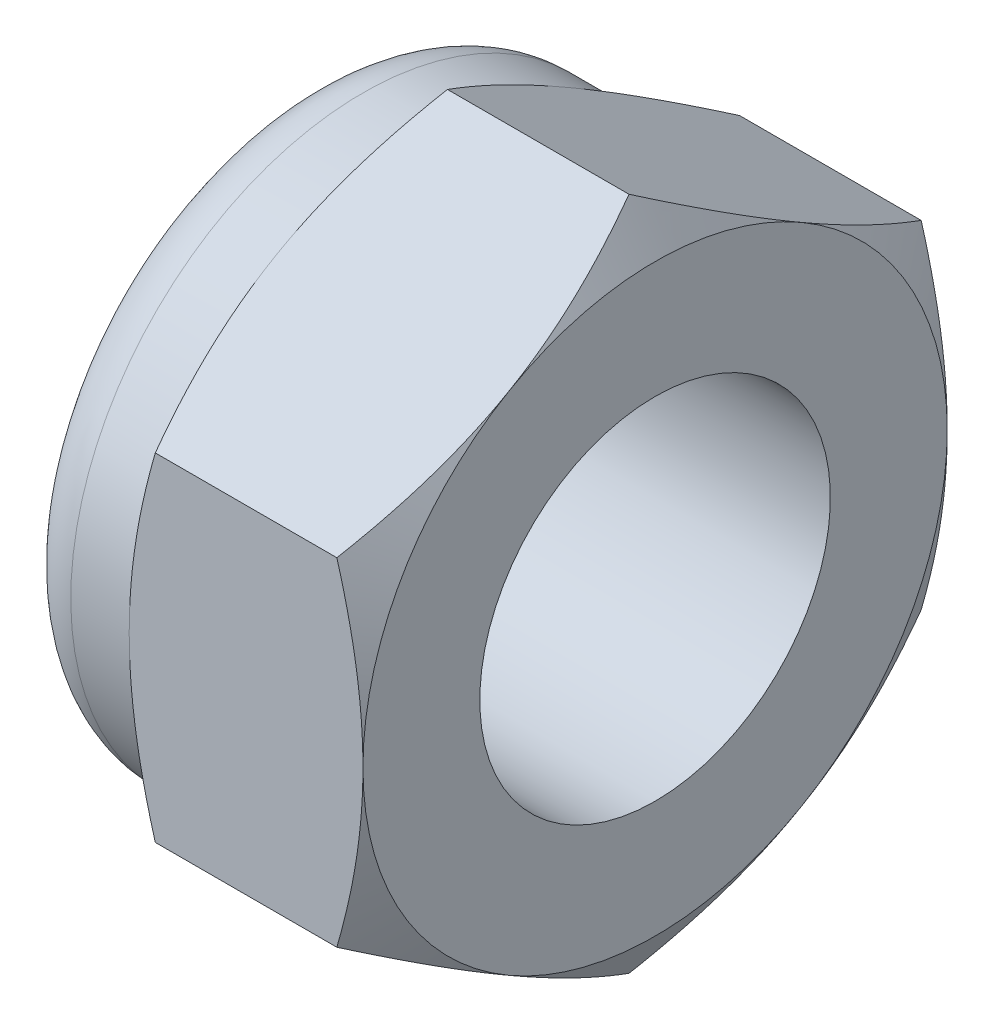
ISO-10303-21;
HEADER;
FILE_DESCRIPTION(('STEP AP214'),'2;1');
FILE_NAME('part.step','',(''),(''),'','','');
FILE_SCHEMA(('AUTOMOTIVE_DESIGN { 1 0 10303 214 1 1 1 1 }'));
ENDSEC;
DATA;
#1=APPLICATION_CONTEXT('core data for automotive mechanical design processes');
#2=APPLICATION_PROTOCOL_DEFINITION('international standard','automotive_design',2000,#1);
#3=PRODUCT_CONTEXT('',#1,'mechanical');
#4=PRODUCT('Part','Part','',(#3));
#5=PRODUCT_RELATED_PRODUCT_CATEGORY('part','',(#4));
#6=PRODUCT_DEFINITION_FORMATION('','',#4);
#7=PRODUCT_DEFINITION_CONTEXT('part definition',#1,'design');
#8=PRODUCT_DEFINITION('design','',#6,#7);
#9=PRODUCT_DEFINITION_SHAPE('','',#8);
#10=(LENGTH_UNIT() NAMED_UNIT(*) SI_UNIT(.MILLI.,.METRE.));
#11=(NAMED_UNIT(*) PLANE_ANGLE_UNIT() SI_UNIT($,.RADIAN.));
#12=(NAMED_UNIT(*) SI_UNIT($,.STERADIAN.) SOLID_ANGLE_UNIT());
#13=UNCERTAINTY_MEASURE_WITH_UNIT(LENGTH_MEASURE(1.E-05),#10,'distance_accuracy_value','');
#14=(GEOMETRIC_REPRESENTATION_CONTEXT(3) GLOBAL_UNCERTAINTY_ASSIGNED_CONTEXT((#13)) GLOBAL_UNIT_ASSIGNED_CONTEXT((#10,
#11,#12)) REPRESENTATION_CONTEXT('',''));
#15=CARTESIAN_POINT('',(0.,0.,0.));
#16=DIRECTION('',(0.,0.,1.));
#17=DIRECTION('',(1.,0.,0.));
#18=AXIS2_PLACEMENT_3D('',#15,#16,#17);
#19=CARTESIAN_POINT('',(-6.,2.88675134594813,-5.));
#20=DIRECTION('',(0.,0.866025403784439,-0.5));
#21=DIRECTION('',(0.,0.5,0.866025403784439));
#22=AXIS2_PLACEMENT_3D('',#19,#20,#21);
#23=PLANE('',#22);
#24=DIRECTION('',(1.,0.,0.));
#25=VECTOR('',#24,1.);
#26=CARTESIAN_POINT('',(-6.,2.88675134594813,-5.));
#27=LINE('',#26,#25);
#28=CARTESIAN_POINT('',(-3.5534180126148,2.88675134594813,-5.));
#29=VERTEX_POINT('',#28);
#30=CARTESIAN_POINT('',(-0.446581987385198,2.88675134594813,-5.));
#31=VERTEX_POINT('',#30);
#32=EDGE_CURVE('E160',#29,#31,#27,.T.);
#33=ORIENTED_EDGE('',*,*,#32,.F.);
#34=CARTESIAN_POINT('',(-3.55335134394818,2.88663587589429,-5.0002));
#35=CARTESIAN_POINT('',(-3.62661343236237,3.01349970319368,-4.78046540547481));
#36=CARTESIAN_POINT('',(-3.69324867808191,3.14144859993849,-4.55885141554042));
#37=CARTESIAN_POINT('',(-3.80956100898919,3.39956193532121,-4.11178600454649));
#38=CARTESIAN_POINT('',(-3.85919695008421,3.52973095989718,-3.88632664040923));
#39=CARTESIAN_POINT('',(-3.9364489745813,3.78847564779798,-3.43816769477649));
#40=CARTESIAN_POINT('',(-3.96457962171651,3.91701101576052,-3.21553790689581));
#41=CARTESIAN_POINT('',(-3.98980507804632,4.11026620624322,-2.88081009815336));
#42=CARTESIAN_POINT('',(-3.99538654023052,4.17472868879311,-2.76915780319494));
#43=CARTESIAN_POINT('',(-4.00079778324853,4.30371322717528,-2.5457500293262));
#44=CARTESIAN_POINT('',(-4.0006277417418,4.36823528110589,-2.43399455370969));
#45=CARTESIAN_POINT('',(-3.99224636820796,4.54500768479194,-2.12781576914936));
#46=CARTESIAN_POINT('',(-3.97817022810275,4.65719946015292,-1.93349391403279));
#47=CARTESIAN_POINT('',(-3.93353474289057,4.88083840557981,-1.54613989800229));
#48=CARTESIAN_POINT('',(-3.90296013985249,4.9922847895602,-1.35310909862843));
#49=CARTESIAN_POINT('',(-3.82653150637884,5.21637431361295,-0.964974657525146));
#50=CARTESIAN_POINT('',(-3.78035362112132,5.32898917185759,-0.769920001358265));
#51=CARTESIAN_POINT('',(-3.67554820550807,5.55253939626498,-0.382719654641232));
#52=CARTESIAN_POINT('',(-3.61694529656263,5.66347762579592,-0.190569004591913));
#53=CARTESIAN_POINT('',(-3.55335134394818,5.7736181619501,0.000200000000000797));
#54=B_SPLINE_CURVE_WITH_KNOTS('',3,(#34,#35,#36,#37,#38,#39,#40,#41,#42,#43,#44,#45,#46,#47,#48,
#49,#50,#51,#52,#53),.UNSPECIFIED.,.F.,.F.,(4,2,2,2,2,2,2,2,2,4),(0.,0.79255584136309,
1.58701660053333,2.3618153748728,2.74884076077325,3.13585419177295,3.80962362599679,
4.48401723901189,5.17336882348928,5.86136694793725),.UNSPECIFIED.);
#55=CARTESIAN_POINT('',(-4.,4.33012701892219,-2.5));
#56=VERTEX_POINT('',#55);
#57=EDGE_CURVE('E280',#29,#56,#54,.T.);
#58=ORIENTED_EDGE('',*,*,#57,.T.);
#59=CARTESIAN_POINT('',(-3.5534180126148,5.77350269189626,0.));
#60=VERTEX_POINT('',#59);
#61=EDGE_CURVE('E274',#56,#60,#54,.T.);
#62=ORIENTED_EDGE('',*,*,#61,.T.);
#63=DIRECTION('',(1.,0.,0.));
#64=VECTOR('',#63,1.);
#65=CARTESIAN_POINT('',(-6.,5.77350269189626,0.));
#66=LINE('',#65,#64);
#67=CARTESIAN_POINT('',(-0.446581987385198,5.77350269189626,0.));
#68=VERTEX_POINT('',#67);
#69=EDGE_CURVE('E167',#60,#68,#66,.T.);
#70=ORIENTED_EDGE('',*,*,#69,.T.);
#71=CARTESIAN_POINT('',(-0.446648656051824,5.7736181619501,0.000200000000000379));
#72=CARTESIAN_POINT('',(-0.373386567637631,5.64675433465071,-0.219534594525184));
#73=CARTESIAN_POINT('',(-0.306751321918089,5.5188054379059,-0.44114858445958));
#74=CARTESIAN_POINT('',(-0.190438991010808,5.26069210252318,-0.888213995453512));
#75=CARTESIAN_POINT('',(-0.140803049915787,5.13052307794721,-1.11367335959077));
#76=CARTESIAN_POINT('',(-0.0635510254186967,4.87177839004641,-1.56183230522351));
#77=CARTESIAN_POINT('',(-0.0354203782834888,4.74324302208387,-1.78446209310419));
#78=CARTESIAN_POINT('',(-0.0101949219536843,4.54998783160116,-2.11918990184664));
#79=CARTESIAN_POINT('',(-0.00461345976948372,4.48552534905128,-2.23084219680506));
#80=CARTESIAN_POINT('',(0.000797783248530016,4.35654081066911,-2.4542499706738));
#81=CARTESIAN_POINT('',(0.000627741741796839,4.2920187567385,-2.56600544629031));
#82=CARTESIAN_POINT('',(-0.00775363179203629,4.11524635305244,-2.87218423085064));
#83=CARTESIAN_POINT('',(-0.0218297718972512,4.00305457769146,-3.06650608596721));
#84=CARTESIAN_POINT('',(-0.06646525710943,3.77941563226457,-3.4538601019977));
#85=CARTESIAN_POINT('',(-0.0970398601475068,3.66796924828419,-3.64689090137157));
#86=CARTESIAN_POINT('',(-0.173468493621162,3.44387972423144,-4.03502534247485));
#87=CARTESIAN_POINT('',(-0.219646378878678,3.3312648659868,-4.23007999864173));
#88=CARTESIAN_POINT('',(-0.324451794491931,3.10771464157941,-4.61728034535877));
#89=CARTESIAN_POINT('',(-0.38305470343737,2.99677641204847,-4.80943099540809));
#90=CARTESIAN_POINT('',(-0.446648656051824,2.88663587589429,-5.0002));
#91=B_SPLINE_CURVE_WITH_KNOTS('',3,(#71,#72,#73,#74,#75,#76,#77,#78,#79,#80,#81,#82,#83,#84,#85,
#86,#87,#88,#89,#90),.UNSPECIFIED.,.F.,.F.,(4,2,2,2,2,2,2,2,2,4),(0.,0.79255584136309,
1.58701660053333,2.3618153748728,2.74884076077325,3.13585419177295,3.80962362599679,
4.48401723901189,5.17336882348928,5.86136694793725),.UNSPECIFIED.);
#92=CARTESIAN_POINT('',(0.,4.33012701892219,-2.5));
#93=VERTEX_POINT('',#92);
#94=EDGE_CURVE('E325',#68,#93,#91,.T.);
#95=ORIENTED_EDGE('',*,*,#94,.T.);
#96=EDGE_CURVE('E228',#93,#31,#91,.T.);
#97=ORIENTED_EDGE('',*,*,#96,.T.);
#98=EDGE_LOOP('',(#33,#58,#62,#70,#95,#97));
#99=FACE_BOUND('',#98,.T.);
#100=ADVANCED_FACE('F32',(#99),#23,.T.);
#101=CARTESIAN_POINT('',(-6.,-2.88675134594813,-5.));
#102=DIRECTION('',(0.,0.,-1.));
#103=DIRECTION('',(0.,1.,0.));
#104=AXIS2_PLACEMENT_3D('',#101,#102,#103);
#105=PLANE('',#104);
#106=DIRECTION('',(1.,0.,0.));
#107=VECTOR('',#106,1.);
#108=CARTESIAN_POINT('',(-6.,-2.88675134594813,-5.));
#109=LINE('',#108,#107);
#110=CARTESIAN_POINT('',(-3.5534180126148,-2.88675134594814,-5.));
#111=VERTEX_POINT('',#110);
#112=CARTESIAN_POINT('',(-0.446581987385198,-2.88675134594814,-5.));
#113=VERTEX_POINT('',#112);
#114=EDGE_CURVE('E157',#111,#113,#109,.T.);
#115=ORIENTED_EDGE('',*,*,#114,.F.);
#116=CARTESIAN_POINT('',(-1.60736647344924,-7.65608998744865,-5.));
#117=CARTESIAN_POINT('',(-1.71345466182796,-7.43656171400166,-5.));
#118=CARTESIAN_POINT('',(-1.81848824538408,-7.21651440170022,-5.));
#119=CARTESIAN_POINT('',(-2.02584356636027,-6.77510105921518,-5.));
#120=CARTESIAN_POINT('',(-2.12816483425435,-6.55373480873052,-5.));
#121=CARTESIAN_POINT('',(-2.33003192146512,-6.10820714710357,-5.));
#122=CARTESIAN_POINT('',(-2.42955850718272,-5.88403698971124,-5.));
#123=CARTESIAN_POINT('',(-2.62433676721321,-5.43385418074677,-5.));
#124=CARTESIAN_POINT('',(-2.71958866435759,-5.20784162594278,-5.));
#125=CARTESIAN_POINT('',(-2.90581169081061,-4.75080884782756,-5.));
#126=CARTESIAN_POINT('',(-2.99671590900132,-4.51976121099505,-5.));
#127=CARTESIAN_POINT('',(-3.17140469702806,-4.05494053422099,-5.));
#128=CARTESIAN_POINT('',(-3.25518847475236,-3.82116719434024,-5.));
#129=CARTESIAN_POINT('',(-3.41338536763539,-3.35100416711889,-5.));
#130=CARTESIAN_POINT('',(-3.48781840477474,-3.11462125088188,-5.));
#131=CARTESIAN_POINT('',(-3.62489560612763,-2.63849247870023,-5.));
#132=CARTESIAN_POINT('',(-3.68754349840306,-2.3987477121033,-5.));
#133=CARTESIAN_POINT('',(-3.79801224600514,-1.91574303714497,-5.));
#134=CARTESIAN_POINT('',(-3.84582915344136,-1.672482210841,-5.));
#135=CARTESIAN_POINT('',(-3.9234044442076,-1.18299359688664,-5.));
#136=CARTESIAN_POINT('',(-3.95316281157159,-0.936765806613283,-5.));
#137=CARTESIAN_POINT('',(-3.9823487984137,-0.56703227932385,-5.));
#138=CARTESIAN_POINT('',(-3.98950368094005,-0.444105297658542,-5.));
#139=CARTESIAN_POINT('',(-3.99860454773096,-0.198053005238567,-5.));
#140=CARTESIAN_POINT('',(-4.00055059963961,-0.074927697080231,-5.));
#141=CARTESIAN_POINT('',(-3.99918152965434,0.17125799989235,-5.));
#142=CARTESIAN_POINT('',(-3.99586788568699,0.294318397227085,-5.));
#143=CARTESIAN_POINT('',(-3.98406340271724,0.540192730788837,-5.));
#144=CARTESIAN_POINT('',(-3.97557230242984,0.663006654263479,-5.));
#145=CARTESIAN_POINT('',(-3.9488936197247,0.960681872881665,-5.));
#146=CARTESIAN_POINT('',(-3.92811103230172,1.1353143627994,-5.));
#147=CARTESIAN_POINT('',(-3.87723434427731,1.4832167579939,-5.));
#148=CARTESIAN_POINT('',(-3.84713900200997,1.65648647841237,-5.));
#149=CARTESIAN_POINT('',(-3.77870120798845,2.00155426058701,-5.));
#150=CARTESIAN_POINT('',(-3.7403505225136,2.17335067370375,-5.));
#151=CARTESIAN_POINT('',(-3.65657169461499,2.51518168221057,-5.));
#152=CARTESIAN_POINT('',(-3.611143983086,2.68521638419313,-5.));
#153=CARTESIAN_POINT('',(-3.51311221794571,3.02770318928895,-5.));
#154=CARTESIAN_POINT('',(-3.46035963617606,3.20011248435316,-5.));
#155=CARTESIAN_POINT('',(-3.34964221269737,3.54310870430181,-5.));
#156=CARTESIAN_POINT('',(-3.29168096609293,3.71369679659719,-5.));
#157=CARTESIAN_POINT('',(-3.17174345927152,4.05236610267979,-5.));
#158=CARTESIAN_POINT('',(-3.10979163457363,4.22045602230061,-5.));
#159=CARTESIAN_POINT('',(-2.98225176586187,4.55533171687455,-5.));
#160=CARTESIAN_POINT('',(-2.91666225221222,4.72211693321421,-5.));
#161=CARTESIAN_POINT('',(-2.84961374182275,4.88829623733362,-5.));
#162=B_SPLINE_CURVE_WITH_KNOTS('',3,(#116,#117,#118,#119,#120,#121,#122,#123,#124,#125,#126,
#127,#128,#129,#130,#131,#132,#133,#134,#135,#136,#137,#138,#139,#140,#141,#142,#143,#144,#145,
#146,#147,#148,#149,#150,#151,#152,#153,#154,#155,#156,#157,#158,#159,#160,#161),.UNSPECIFIED.,
.F.,.F.,(4,2,2,2,2,2,2,2,2,2,2,2,2,2,2,2,2,2,2,2,2,2,4),(0.,0.73146474066535,1.46305528824908,
2.19883243307486,2.93457117856033,3.67934251246857,4.42419659013361,5.16743580871988,
5.91043951739338,6.65364083834805,7.39684281638514,7.76615414335455,8.13546067426609,
8.50466345177854,8.87388486298451,9.40118542949726,9.92855633110015,10.4564556797854,
10.9843228991235,11.525120280828,12.065547221064,12.6029322754131,13.1405360390026),.UNSPECIFIED.);
#163=CARTESIAN_POINT('',(-4.,0.,-5.));
#164=VERTEX_POINT('',#163);
#165=EDGE_CURVE('E150',#111,#164,#162,.T.);
#166=ORIENTED_EDGE('',*,*,#165,.T.);
#167=EDGE_CURVE('E243',#164,#29,#162,.T.);
#168=ORIENTED_EDGE('',*,*,#167,.T.);
#169=ORIENTED_EDGE('',*,*,#32,.T.);
#170=CARTESIAN_POINT('',(-2.39263352655076,-7.65608998744865,-5.));
#171=CARTESIAN_POINT('',(-2.28654533817204,-7.43656171400166,-5.));
#172=CARTESIAN_POINT('',(-2.18151175461592,-7.21651440170022,-5.));
#173=CARTESIAN_POINT('',(-1.97415643363973,-6.77510105921518,-5.));
#174=CARTESIAN_POINT('',(-1.87183516574565,-6.55373480873053,-5.));
#175=CARTESIAN_POINT('',(-1.66996807853488,-6.10820714710357,-5.));
#176=CARTESIAN_POINT('',(-1.57044149281728,-5.88403698971125,-5.));
#177=CARTESIAN_POINT('',(-1.37566323278679,-5.43385418074677,-5.));
#178=CARTESIAN_POINT('',(-1.28041133564241,-5.20784162594278,-5.));
#179=CARTESIAN_POINT('',(-1.0941883091894,-4.75080884782756,-5.));
#180=CARTESIAN_POINT('',(-1.00328409099868,-4.51976121099505,-5.));
#181=CARTESIAN_POINT('',(-0.828595302971936,-4.054940534221,-5.));
#182=CARTESIAN_POINT('',(-0.74481152524764,-3.82116719434025,-5.));
#183=CARTESIAN_POINT('',(-0.58661463236461,-3.35100416711889,-5.));
#184=CARTESIAN_POINT('',(-0.512181595225262,-3.11462125088188,-5.));
#185=CARTESIAN_POINT('',(-0.37510439387237,-2.63849247870023,-5.));
#186=CARTESIAN_POINT('',(-0.312456501596944,-2.3987477121033,-5.));
#187=CARTESIAN_POINT('',(-0.201987753994865,-1.91574303714497,-5.));
#188=CARTESIAN_POINT('',(-0.154170846558639,-1.672482210841,-5.));
#189=CARTESIAN_POINT('',(-0.0765955557924009,-1.18299359688664,-5.));
#190=CARTESIAN_POINT('',(-0.0468371884284084,-0.936765806613281,-5.));
#191=CARTESIAN_POINT('',(-0.0176512015862956,-0.567032279323849,-5.));
#192=CARTESIAN_POINT('',(-0.0104963190599459,-0.444105297658541,-5.));
#193=CARTESIAN_POINT('',(-0.00139545226903983,-0.198053005238567,-5.));
#194=CARTESIAN_POINT('',(0.000550599639615223,-0.074927697080231,-5.));
#195=CARTESIAN_POINT('',(-0.000818470345663275,0.17125799989235,-5.));
#196=CARTESIAN_POINT('',(-0.00413211431301054,0.294318397227085,-5.));
#197=CARTESIAN_POINT('',(-0.0159365972827586,0.540192730788837,-5.));
#198=CARTESIAN_POINT('',(-0.0244276975701636,0.663006654263479,-5.));
#199=CARTESIAN_POINT('',(-0.0511063802752994,0.960681872881665,-5.));
#200=CARTESIAN_POINT('',(-0.0718889676982849,1.1353143627994,-5.));
#201=CARTESIAN_POINT('',(-0.122765655722694,1.4832167579939,-5.));
#202=CARTESIAN_POINT('',(-0.152860997990033,1.65648647841237,-5.));
#203=CARTESIAN_POINT('',(-0.221298792011551,2.00155426058701,-5.));
#204=CARTESIAN_POINT('',(-0.259649477486405,2.17335067370375,-5.));
#205=CARTESIAN_POINT('',(-0.343428305385012,2.51518168221057,-5.));
#206=CARTESIAN_POINT('',(-0.388856016914003,2.68521638419313,-5.));
#207=CARTESIAN_POINT('',(-0.486887782054295,3.02770318928895,-5.));
#208=CARTESIAN_POINT('',(-0.539640363823945,3.20011248435316,-5.));
#209=CARTESIAN_POINT('',(-0.65035778730263,3.54310870430181,-5.));
#210=CARTESIAN_POINT('',(-0.708319033907075,3.71369679659719,-5.));
#211=CARTESIAN_POINT('',(-0.828256540728481,4.05236610267979,-5.));
#212=CARTESIAN_POINT('',(-0.890208365426372,4.22045602230062,-5.));
#213=CARTESIAN_POINT('',(-1.01774823413813,4.55533171687455,-5.));
#214=CARTESIAN_POINT('',(-1.08333774778778,4.72211693321421,-5.));
#215=CARTESIAN_POINT('',(-1.15038625817725,4.88829623733363,-5.));
#216=B_SPLINE_CURVE_WITH_KNOTS('',3,(#170,#171,#172,#173,#174,#175,#176,#177,#178,#179,#180,
#181,#182,#183,#184,#185,#186,#187,#188,#189,#190,#191,#192,#193,#194,#195,#196,#197,#198,#199,
#200,#201,#202,#203,#204,#205,#206,#207,#208,#209,#210,#211,#212,#213,#214,#215),.UNSPECIFIED.,
.F.,.F.,(4,2,2,2,2,2,2,2,2,2,2,2,2,2,2,2,2,2,2,2,2,2,4),(0.,0.73146474066535,1.46305528824908,
2.19883243307485,2.93457117856033,3.67934251246857,4.4241965901336,5.16743580871988,
5.91043951739338,6.65364083834805,7.39684281638514,7.76615414335455,8.13546067426609,
8.50466345177854,8.87388486298451,9.40118542949726,9.92855633110015,10.4564556797854,
10.9843228991235,11.525120280828,12.0655472210641,12.6029322754131,13.1405360390026),.UNSPECIFIED.);
#217=CARTESIAN_POINT('',(0.,0.,-5.));
#218=VERTEX_POINT('',#217);
#219=EDGE_CURVE('E226',#31,#218,#216,.F.);
#220=ORIENTED_EDGE('',*,*,#219,.T.);
#221=EDGE_CURVE('E219',#218,#113,#216,.F.);
#222=ORIENTED_EDGE('',*,*,#221,.T.);
#223=EDGE_LOOP('',(#115,#166,#168,#169,#220,#222));
#224=FACE_BOUND('',#223,.T.);
#225=ADVANCED_FACE('F234',(#224),#105,.T.);
#226=CARTESIAN_POINT('',(-6.,-5.77350269189626,0.));
#227=DIRECTION('',(0.,-0.866025403784439,-0.5));
#228=DIRECTION('',(0.,0.5,-0.866025403784439));
#229=AXIS2_PLACEMENT_3D('',#226,#227,#228);
#230=PLANE('',#229);
#231=DIRECTION('',(1.,0.,0.));
#232=VECTOR('',#231,1.);
#233=CARTESIAN_POINT('',(-6.,-5.77350269189626,0.));
#234=LINE('',#233,#232);
#235=CARTESIAN_POINT('',(-3.5534180126148,-5.77350269189626,0.));
#236=VERTEX_POINT('',#235);
#237=CARTESIAN_POINT('',(-0.446581987385197,-5.77350269189626,0.));
#238=VERTEX_POINT('',#237);
#239=EDGE_CURVE('E147',#236,#238,#234,.T.);
#240=ORIENTED_EDGE('',*,*,#239,.F.);
#241=CARTESIAN_POINT('',(-3.55335134394818,-5.7736181619501,0.000200000000000594));
#242=CARTESIAN_POINT('',(-3.62661343236237,-5.64675433465071,-0.219534594525184));
#243=CARTESIAN_POINT('',(-3.69324867808191,-5.5188054379059,-0.441148584459579));
#244=CARTESIAN_POINT('',(-3.80956100898919,-5.26069210252318,-0.888213995453512));
#245=CARTESIAN_POINT('',(-3.85919695008421,-5.13052307794721,-1.11367335959077));
#246=CARTESIAN_POINT('',(-3.9364489745813,-4.87177839004641,-1.56183230522351));
#247=CARTESIAN_POINT('',(-3.96457962171651,-4.74324302208387,-1.78446209310419));
#248=CARTESIAN_POINT('',(-3.98980507804631,-4.54998783160116,-2.11918990184664));
#249=CARTESIAN_POINT('',(-3.99538654023052,-4.48552534905128,-2.23084219680506));
#250=CARTESIAN_POINT('',(-4.00079778324853,-4.35654081066911,-2.4542499706738));
#251=CARTESIAN_POINT('',(-4.0006277417418,-4.2920187567385,-2.56600544629031));
#252=CARTESIAN_POINT('',(-3.99224636820796,-4.11524635305245,-2.87218423085064));
#253=CARTESIAN_POINT('',(-3.97817022810275,-4.00305457769146,-3.06650608596721));
#254=CARTESIAN_POINT('',(-3.93353474289057,-3.77941563226458,-3.4538601019977));
#255=CARTESIAN_POINT('',(-3.90296013985249,-3.66796924828419,-3.64689090137157));
#256=CARTESIAN_POINT('',(-3.82653150637884,-3.44387972423144,-4.03502534247485));
#257=CARTESIAN_POINT('',(-3.78035362112132,-3.3312648659868,-4.23007999864173));
#258=CARTESIAN_POINT('',(-3.67554820550807,-3.10771464157941,-4.61728034535877));
#259=CARTESIAN_POINT('',(-3.61694529656263,-2.99677641204847,-4.80943099540809));
#260=CARTESIAN_POINT('',(-3.55335134394818,-2.88663587589429,-5.0002));
#261=B_SPLINE_CURVE_WITH_KNOTS('',3,(#241,#242,#243,#244,#245,#246,#247,#248,#249,#250,#251,
#252,#253,#254,#255,#256,#257,#258,#259,#260),.UNSPECIFIED.,.F.,.F.,(4,2,2,2,2,2,2,2,2,4),(0.,
0.792555841363089,1.58701660053333,2.3618153748728,2.74884076077325,3.13585419177295,
3.80962362599679,4.48401723901189,5.17336882348928,5.86136694793725),.UNSPECIFIED.);
#262=CARTESIAN_POINT('',(-4.,-4.3301270189222,-2.5));
#263=VERTEX_POINT('',#262);
#264=EDGE_CURVE('E129',#236,#263,#261,.T.);
#265=ORIENTED_EDGE('',*,*,#264,.T.);
#266=EDGE_CURVE('E140',#263,#111,#261,.T.);
#267=ORIENTED_EDGE('',*,*,#266,.T.);
#268=ORIENTED_EDGE('',*,*,#114,.T.);
#269=CARTESIAN_POINT('',(-0.446648656051825,-2.88663587589429,-5.0002));
#270=CARTESIAN_POINT('',(-0.373386567637631,-3.01349970319368,-4.78046540547481));
#271=CARTESIAN_POINT('',(-0.306751321918089,-3.14144859993849,-4.55885141554042));
#272=CARTESIAN_POINT('',(-0.190438991010809,-3.39956193532121,-4.11178600454648));
#273=CARTESIAN_POINT('',(-0.140803049915788,-3.52973095989718,-3.88632664040922));
#274=CARTESIAN_POINT('',(-0.0635510254186972,-3.78847564779798,-3.43816769477649));
#275=CARTESIAN_POINT('',(-0.0354203782834888,-3.91701101576052,-3.21553790689581));
#276=CARTESIAN_POINT('',(-0.0101949219536844,-4.11026620624323,-2.88081009815336));
#277=CARTESIAN_POINT('',(-0.00461345976948411,-4.17472868879311,-2.76915780319494));
#278=CARTESIAN_POINT('',(0.000797783248529389,-4.30371322717528,-2.5457500293262));
#279=CARTESIAN_POINT('',(0.000627741741796204,-4.36823528110589,-2.43399455370968));
#280=CARTESIAN_POINT('',(-0.00775363179203693,-4.54500768479195,-2.12781576914936));
#281=CARTESIAN_POINT('',(-0.0218297718972518,-4.65719946015293,-1.93349391403278));
#282=CARTESIAN_POINT('',(-0.0664652571094306,-4.88083840557981,-1.54613989800229));
#283=CARTESIAN_POINT('',(-0.0970398601475074,-4.9922847895602,-1.35310909862843));
#284=CARTESIAN_POINT('',(-0.173468493621162,-5.21637431361295,-0.964974657525144));
#285=CARTESIAN_POINT('',(-0.219646378878678,-5.32898917185759,-0.769920001358263));
#286=CARTESIAN_POINT('',(-0.324451794491931,-5.55253939626498,-0.382719654641231));
#287=CARTESIAN_POINT('',(-0.383054703437371,-5.66347762579592,-0.190569004591912));
#288=CARTESIAN_POINT('',(-0.446648656051824,-5.7736181619501,0.000200000000001509));
#289=B_SPLINE_CURVE_WITH_KNOTS('',3,(#269,#270,#271,#272,#273,#274,#275,#276,#277,#278,#279,
#280,#281,#282,#283,#284,#285,#286,#287,#288),.UNSPECIFIED.,.F.,.F.,(4,2,2,2,2,2,2,2,2,4),(0.,
0.79255584136309,1.58701660053333,2.3618153748728,2.74884076077325,3.13585419177295,
3.80962362599679,4.48401723901189,5.17336882348928,5.86136694793725),.UNSPECIFIED.);
#290=CARTESIAN_POINT('',(0.,-4.3301270189222,-2.5));
#291=VERTEX_POINT('',#290);
#292=EDGE_CURVE('E227',#113,#291,#289,.T.);
#293=ORIENTED_EDGE('',*,*,#292,.T.);
#294=EDGE_CURVE('E156',#291,#238,#289,.T.);
#295=ORIENTED_EDGE('',*,*,#294,.T.);
#296=EDGE_LOOP('',(#240,#265,#267,#268,#293,#295));
#297=FACE_BOUND('',#296,.T.);
#298=ADVANCED_FACE('F153',(#297),#230,.T.);
#299=CARTESIAN_POINT('',(-6.,-2.88675134594813,5.));
#300=DIRECTION('',(0.,-0.866025403784439,0.5));
#301=DIRECTION('',(0.,-0.5,-0.866025403784439));
#302=AXIS2_PLACEMENT_3D('',#299,#300,#301);
#303=PLANE('',#302);
#304=DIRECTION('',(1.,0.,0.));
#305=VECTOR('',#304,1.);
#306=CARTESIAN_POINT('',(-6.,-2.88675134594813,5.));
#307=LINE('',#306,#305);
#308=CARTESIAN_POINT('',(-3.5534180126148,-2.88675134594813,5.));
#309=VERTEX_POINT('',#308);
#310=CARTESIAN_POINT('',(-0.446581987385198,-2.88675134594813,5.));
#311=VERTEX_POINT('',#310);
#312=EDGE_CURVE('E158',#309,#311,#307,.T.);
#313=ORIENTED_EDGE('',*,*,#312,.F.);
#314=CARTESIAN_POINT('',(-3.55335134394818,-2.88663587589429,5.0002));
#315=CARTESIAN_POINT('',(-3.62661343236237,-3.01349970319368,4.78046540547482));
#316=CARTESIAN_POINT('',(-3.69324867808191,-3.14144859993849,4.55885141554042));
#317=CARTESIAN_POINT('',(-3.80956100898919,-3.39956193532121,4.11178600454649));
#318=CARTESIAN_POINT('',(-3.85919695008421,-3.52973095989718,3.88632664040923));
#319=CARTESIAN_POINT('',(-3.9364489745813,-3.78847564779798,3.43816769477649));
#320=CARTESIAN_POINT('',(-3.96457962171651,-3.91701101576052,3.21553790689581));
#321=CARTESIAN_POINT('',(-3.98980507804631,-4.11026620624322,2.88081009815336));
#322=CARTESIAN_POINT('',(-3.99538654023052,-4.17472868879311,2.76915780319494));
#323=CARTESIAN_POINT('',(-4.00079778324853,-4.30371322717528,2.54575002932621));
#324=CARTESIAN_POINT('',(-4.0006277417418,-4.36823528110589,2.43399455370969));
#325=CARTESIAN_POINT('',(-3.99224636820796,-4.54500768479194,2.12781576914936));
#326=CARTESIAN_POINT('',(-3.97817022810275,-4.65719946015292,1.93349391403279));
#327=CARTESIAN_POINT('',(-3.93353474289057,-4.88083840557981,1.5461398980023));
#328=CARTESIAN_POINT('',(-3.90296013985249,-4.9922847895602,1.35310909862843));
#329=CARTESIAN_POINT('',(-3.82653150637884,-5.21637431361295,0.964974657525146));
#330=CARTESIAN_POINT('',(-3.78035362112132,-5.32898917185759,0.769920001358265));
#331=CARTESIAN_POINT('',(-3.67554820550807,-5.55253939626498,0.382719654641232));
#332=CARTESIAN_POINT('',(-3.61694529656263,-5.66347762579592,0.190569004591913));
#333=CARTESIAN_POINT('',(-3.55335134394818,-5.7736181619501,-0.000199999999999506));
#334=B_SPLINE_CURVE_WITH_KNOTS('',3,(#314,#315,#316,#317,#318,#319,#320,#321,#322,#323,#324,
#325,#326,#327,#328,#329,#330,#331,#332,#333),.UNSPECIFIED.,.F.,.F.,(4,2,2,2,2,2,2,2,2,4),(0.,
0.79255584136309,1.58701660053333,2.3618153748728,2.74884076077325,3.13585419177295,
3.80962362599679,4.48401723901189,5.17336882348928,5.86136694793725),.UNSPECIFIED.);
#335=CARTESIAN_POINT('',(-4.,-4.33012701892219,2.5));
#336=VERTEX_POINT('',#335);
#337=EDGE_CURVE('E149',#309,#336,#334,.T.);
#338=ORIENTED_EDGE('',*,*,#337,.T.);
#339=EDGE_CURVE('E132',#336,#236,#334,.T.);
#340=ORIENTED_EDGE('',*,*,#339,.T.);
#341=ORIENTED_EDGE('',*,*,#239,.T.);
#342=CARTESIAN_POINT('',(-0.446648656051824,-5.7736181619501,-0.000199999999999416));
#343=CARTESIAN_POINT('',(-0.373386567637631,-5.64675433465071,0.219534594525186));
#344=CARTESIAN_POINT('',(-0.306751321918089,-5.5188054379059,0.441148584459581));
#345=CARTESIAN_POINT('',(-0.190438991010809,-5.26069210252318,0.888213995453513));
#346=CARTESIAN_POINT('',(-0.140803049915787,-5.13052307794721,1.11367335959077));
#347=CARTESIAN_POINT('',(-0.0635510254186971,-4.87177839004641,1.56183230522351));
#348=CARTESIAN_POINT('',(-0.0354203782834887,-4.74324302208387,1.78446209310419));
#349=CARTESIAN_POINT('',(-0.0101949219536841,-4.54998783160116,2.11918990184664));
#350=CARTESIAN_POINT('',(-0.00461345976948366,-4.48552534905128,2.23084219680506));
#351=CARTESIAN_POINT('',(0.000797783248530128,-4.35654081066911,2.4542499706738));
#352=CARTESIAN_POINT('',(0.000627741741797073,-4.2920187567385,2.56600544629031));
#353=CARTESIAN_POINT('',(-0.00775363179203595,-4.11524635305244,2.87218423085064));
#354=CARTESIAN_POINT('',(-0.0218297718972511,-4.00305457769146,3.06650608596721));
#355=CARTESIAN_POINT('',(-0.0664652571094302,-3.77941563226458,3.4538601019977));
#356=CARTESIAN_POINT('',(-0.0970398601475071,-3.66796924828419,3.64689090137157));
#357=CARTESIAN_POINT('',(-0.173468493621162,-3.44387972423144,4.03502534247485));
#358=CARTESIAN_POINT('',(-0.219646378878678,-3.3312648659868,4.23007999864173));
#359=CARTESIAN_POINT('',(-0.324451794491931,-3.10771464157941,4.61728034535877));
#360=CARTESIAN_POINT('',(-0.38305470343737,-2.99677641204847,4.80943099540809));
#361=CARTESIAN_POINT('',(-0.446648656051825,-2.88663587589429,5.0002));
#362=B_SPLINE_CURVE_WITH_KNOTS('',3,(#342,#343,#344,#345,#346,#347,#348,#349,#350,#351,#352,
#353,#354,#355,#356,#357,#358,#359,#360,#361),.UNSPECIFIED.,.F.,.F.,(4,2,2,2,2,2,2,2,2,4),(0.,
0.792555841363089,1.58701660053333,2.3618153748728,2.74884076077325,3.13585419177295,
3.80962362599679,4.48401723901189,5.17336882348928,5.86136694793725),.UNSPECIFIED.);
#363=CARTESIAN_POINT('',(0.,-4.33012701892219,2.5));
#364=VERTEX_POINT('',#363);
#365=EDGE_CURVE('E298',#238,#364,#362,.T.);
#366=ORIENTED_EDGE('',*,*,#365,.T.);
#367=EDGE_CURVE('E206',#364,#311,#362,.T.);
#368=ORIENTED_EDGE('',*,*,#367,.T.);
#369=EDGE_LOOP('',(#313,#338,#340,#341,#366,#368));
#370=FACE_BOUND('',#369,.T.);
#371=ADVANCED_FACE('F145',(#370),#303,.T.);
#372=CARTESIAN_POINT('',(-6.,2.88675134594813,5.));
#373=DIRECTION('',(0.,0.,1.));
#374=DIRECTION('',(1.,0.,0.));
#375=AXIS2_PLACEMENT_3D('',#372,#373,#374);
#376=PLANE('',#375);
#377=DIRECTION('',(1.,0.,0.));
#378=VECTOR('',#377,1.);
#379=CARTESIAN_POINT('',(-6.,2.88675134594813,5.));
#380=LINE('',#379,#378);
#381=CARTESIAN_POINT('',(-3.5534180126148,2.88675134594813,5.));
#382=VERTEX_POINT('',#381);
#383=CARTESIAN_POINT('',(-0.446581987385198,2.88675134594813,5.));
#384=VERTEX_POINT('',#383);
#385=EDGE_CURVE('E162',#382,#384,#380,.T.);
#386=ORIENTED_EDGE('',*,*,#385,.F.);
#387=CARTESIAN_POINT('',(-1.60736647344924,-7.65608998744865,5.));
#388=CARTESIAN_POINT('',(-1.71345466182797,-7.43656171400166,5.));
#389=CARTESIAN_POINT('',(-1.81848824538408,-7.21651440170021,5.));
#390=CARTESIAN_POINT('',(-2.02584356636027,-6.77510105921518,5.));
#391=CARTESIAN_POINT('',(-2.12816483425435,-6.55373480873052,5.));
#392=CARTESIAN_POINT('',(-2.33003192146512,-6.10820714710356,5.));
#393=CARTESIAN_POINT('',(-2.42955850718272,-5.88403698971124,5.));
#394=CARTESIAN_POINT('',(-2.62433676721321,-5.43385418074676,5.));
#395=CARTESIAN_POINT('',(-2.71958866435759,-5.20784162594277,5.));
#396=CARTESIAN_POINT('',(-2.90581169081061,-4.75080884782755,5.));
#397=CARTESIAN_POINT('',(-2.99671590900132,-4.51976121099505,5.));
#398=CARTESIAN_POINT('',(-3.17140469702806,-4.05494053422099,5.));
#399=CARTESIAN_POINT('',(-3.25518847475236,-3.82116719434024,5.));
#400=CARTESIAN_POINT('',(-3.41338536763539,-3.35100416711888,5.));
#401=CARTESIAN_POINT('',(-3.48781840477474,-3.11462125088187,5.));
#402=CARTESIAN_POINT('',(-3.62489560612763,-2.63849247870023,5.));
#403=CARTESIAN_POINT('',(-3.68754349840306,-2.3987477121033,5.));
#404=CARTESIAN_POINT('',(-3.79801224600513,-1.91574303714497,5.));
#405=CARTESIAN_POINT('',(-3.84582915344136,-1.67248221084099,5.));
#406=CARTESIAN_POINT('',(-3.9234044442076,-1.18299359688664,5.));
#407=CARTESIAN_POINT('',(-3.95316281157159,-0.936765806613279,5.));
#408=CARTESIAN_POINT('',(-3.9823487984137,-0.567032279323846,5.));
#409=CARTESIAN_POINT('',(-3.98950368094005,-0.444105297658539,5.));
#410=CARTESIAN_POINT('',(-3.99860454773096,-0.198053005238565,5.));
#411=CARTESIAN_POINT('',(-4.00055059963961,-0.0749276970802284,5.));
#412=CARTESIAN_POINT('',(-3.99918152965434,0.171257999892353,5.));
#413=CARTESIAN_POINT('',(-3.99586788568699,0.294318397227088,5.));
#414=CARTESIAN_POINT('',(-3.98406340271724,0.540192730788841,5.));
#415=CARTESIAN_POINT('',(-3.97557230242983,0.663006654263484,5.));
#416=CARTESIAN_POINT('',(-3.9488936197247,0.960681872881669,5.));
#417=CARTESIAN_POINT('',(-3.92811103230171,1.1353143627994,5.));
#418=CARTESIAN_POINT('',(-3.8772343442773,1.4832167579939,5.));
#419=CARTESIAN_POINT('',(-3.84713900200997,1.65648647841238,5.));
#420=CARTESIAN_POINT('',(-3.77870120798845,2.00155426058701,5.));
#421=CARTESIAN_POINT('',(-3.74035052251359,2.17335067370376,5.));
#422=CARTESIAN_POINT('',(-3.65657169461499,2.51518168221057,5.));
#423=CARTESIAN_POINT('',(-3.61114398308599,2.68521638419314,5.));
#424=CARTESIAN_POINT('',(-3.5131122179457,3.02770318928896,5.));
#425=CARTESIAN_POINT('',(-3.46035963617605,3.20011248435316,5.));
#426=CARTESIAN_POINT('',(-3.34964221269737,3.54310870430182,5.));
#427=CARTESIAN_POINT('',(-3.29168096609292,3.7136967965972,5.));
#428=CARTESIAN_POINT('',(-3.17174345927152,4.0523661026798,5.));
#429=CARTESIAN_POINT('',(-3.10979163457362,4.22045602230062,5.));
#430=CARTESIAN_POINT('',(-2.98225176586187,4.55533171687455,5.));
#431=CARTESIAN_POINT('',(-2.91666225221222,4.72211693321422,5.));
#432=CARTESIAN_POINT('',(-2.84961374182274,4.88829623733363,5.));
#433=B_SPLINE_CURVE_WITH_KNOTS('',3,(#387,#388,#389,#390,#391,#392,#393,#394,#395,#396,#397,
#398,#399,#400,#401,#402,#403,#404,#405,#406,#407,#408,#409,#410,#411,#412,#413,#414,#415,#416,
#417,#418,#419,#420,#421,#422,#423,#424,#425,#426,#427,#428,#429,#430,#431,#432),.UNSPECIFIED.,
.F.,.F.,(4,2,2,2,2,2,2,2,2,2,2,2,2,2,2,2,2,2,2,2,2,2,4),(0.,0.73146474066535,1.46305528824908,
2.19883243307486,2.93457117856033,3.67934251246857,4.42419659013361,5.16743580871988,
5.91043951739338,6.65364083834805,7.39684281638514,7.76615414335455,8.13546067426609,
8.50466345177854,8.87388486298451,9.40118542949726,9.92855633110015,10.4564556797854,
10.9843228991235,11.525120280828,12.0655472210641,12.6029322754131,13.1405360390026),.UNSPECIFIED.);
#434=CARTESIAN_POINT('',(-4.,0.,5.));
#435=VERTEX_POINT('',#434);
#436=EDGE_CURVE('E52',#382,#435,#433,.F.);
#437=ORIENTED_EDGE('',*,*,#436,.T.);
#438=EDGE_CURVE('E284',#435,#309,#433,.F.);
#439=ORIENTED_EDGE('',*,*,#438,.T.);
#440=ORIENTED_EDGE('',*,*,#312,.T.);
#441=CARTESIAN_POINT('',(-2.39263352655076,-7.65608998744865,5.));
#442=CARTESIAN_POINT('',(-2.28654533817204,-7.43656171400166,5.));
#443=CARTESIAN_POINT('',(-2.18151175461592,-7.21651440170021,5.));
#444=CARTESIAN_POINT('',(-1.97415643363973,-6.77510105921518,5.));
#445=CARTESIAN_POINT('',(-1.87183516574565,-6.55373480873052,5.));
#446=CARTESIAN_POINT('',(-1.66996807853488,-6.10820714710356,5.));
#447=CARTESIAN_POINT('',(-1.57044149281728,-5.88403698971124,5.));
#448=CARTESIAN_POINT('',(-1.37566323278679,-5.43385418074676,5.));
#449=CARTESIAN_POINT('',(-1.28041133564241,-5.20784162594277,5.));
#450=CARTESIAN_POINT('',(-1.09418830918939,-4.75080884782755,5.));
#451=CARTESIAN_POINT('',(-1.00328409099868,-4.51976121099505,5.));
#452=CARTESIAN_POINT('',(-0.828595302971935,-4.05494053422099,5.));
#453=CARTESIAN_POINT('',(-0.744811525247639,-3.82116719434024,5.));
#454=CARTESIAN_POINT('',(-0.586614632364609,-3.35100416711889,5.));
#455=CARTESIAN_POINT('',(-0.512181595225263,-3.11462125088187,5.));
#456=CARTESIAN_POINT('',(-0.375104393872371,-2.63849247870023,5.));
#457=CARTESIAN_POINT('',(-0.312456501596944,-2.3987477121033,5.));
#458=CARTESIAN_POINT('',(-0.201987753994866,-1.91574303714497,5.));
#459=CARTESIAN_POINT('',(-0.15417084655864,-1.67248221084099,5.));
#460=CARTESIAN_POINT('',(-0.0765955557924017,-1.18299359688664,5.));
#461=CARTESIAN_POINT('',(-0.046837188428409,-0.936765806613279,5.));
#462=CARTESIAN_POINT('',(-0.0176512015862966,-0.567032279323846,5.));
#463=CARTESIAN_POINT('',(-0.0104963190599472,-0.444105297658538,5.));
#464=CARTESIAN_POINT('',(-0.0013954522690412,-0.198053005238564,5.));
#465=CARTESIAN_POINT('',(0.000550599639614004,-0.0749276970802281,5.));
#466=CARTESIAN_POINT('',(-0.000818470345664571,0.171257999892353,5.));
#467=CARTESIAN_POINT('',(-0.00413211431301209,0.294318397227089,5.));
#468=CARTESIAN_POINT('',(-0.0159365972827604,0.540192730788841,5.));
#469=CARTESIAN_POINT('',(-0.0244276975701653,0.663006654263483,5.));
#470=CARTESIAN_POINT('',(-0.051106380275301,0.96068187288167,5.));
#471=CARTESIAN_POINT('',(-0.0718889676982864,1.1353143627994,5.));
#472=CARTESIAN_POINT('',(-0.122765655722696,1.4832167579939,5.));
#473=CARTESIAN_POINT('',(-0.152860997990035,1.65648647841238,5.));
#474=CARTESIAN_POINT('',(-0.221298792011553,2.00155426058701,5.));
#475=CARTESIAN_POINT('',(-0.259649477486407,2.17335067370376,5.));
#476=CARTESIAN_POINT('',(-0.343428305385015,2.51518168221057,5.));
#477=CARTESIAN_POINT('',(-0.388856016914007,2.68521638419314,5.));
#478=CARTESIAN_POINT('',(-0.486887782054299,3.02770318928896,5.));
#479=CARTESIAN_POINT('',(-0.539640363823949,3.20011248435317,5.));
#480=CARTESIAN_POINT('',(-0.650357787302635,3.54310870430182,5.));
#481=CARTESIAN_POINT('',(-0.70831903390708,3.7136967965972,5.));
#482=CARTESIAN_POINT('',(-0.828256540728485,4.0523661026798,5.));
#483=CARTESIAN_POINT('',(-0.890208365426377,4.22045602230063,5.));
#484=CARTESIAN_POINT('',(-1.01774823413813,4.55533171687456,5.));
#485=CARTESIAN_POINT('',(-1.08333774778779,4.72211693321422,5.));
#486=CARTESIAN_POINT('',(-1.15038625817726,4.88829623733364,5.));
#487=B_SPLINE_CURVE_WITH_KNOTS('',3,(#441,#442,#443,#444,#445,#446,#447,#448,#449,#450,#451,
#452,#453,#454,#455,#456,#457,#458,#459,#460,#461,#462,#463,#464,#465,#466,#467,#468,#469,#470,
#471,#472,#473,#474,#475,#476,#477,#478,#479,#480,#481,#482,#483,#484,#485,#486),.UNSPECIFIED.,
.F.,.F.,(4,2,2,2,2,2,2,2,2,2,2,2,2,2,2,2,2,2,2,2,2,2,4),(0.,0.731464740665351,1.46305528824908,
2.19883243307486,2.93457117856033,3.67934251246857,4.4241965901336,5.16743580871988,
5.91043951739337,6.65364083834805,7.39684281638514,7.76615414335455,8.13546067426609,
8.50466345177854,8.87388486298451,9.40118542949726,9.92855633110015,10.4564556797854,
10.9843228991235,11.525120280828,12.0655472210641,12.6029322754131,13.1405360390026),.UNSPECIFIED.);
#488=CARTESIAN_POINT('',(0.,0.,5.));
#489=VERTEX_POINT('',#488);
#490=EDGE_CURVE('E301',#311,#489,#487,.T.);
#491=ORIENTED_EDGE('',*,*,#490,.T.);
#492=EDGE_CURVE('E198',#489,#384,#487,.T.);
#493=ORIENTED_EDGE('',*,*,#492,.T.);
#494=EDGE_LOOP('',(#386,#437,#439,#440,#491,#493));
#495=FACE_BOUND('',#494,.T.);
#496=ADVANCED_FACE('F291',(#495),#376,.T.);
#497=CARTESIAN_POINT('',(-6.,5.77350269189626,0.));
#498=DIRECTION('',(0.,0.866025403784439,0.5));
#499=DIRECTION('',(0.,-0.5,0.866025403784439));
#500=AXIS2_PLACEMENT_3D('',#497,#498,#499);
#501=PLANE('',#500);
#502=ORIENTED_EDGE('',*,*,#69,.F.);
#503=CARTESIAN_POINT('',(-3.55335134394818,5.7736181619501,-0.000199999999999703));
#504=CARTESIAN_POINT('',(-3.62661343236237,5.64675433465071,0.219534594525185));
#505=CARTESIAN_POINT('',(-3.69324867808191,5.5188054379059,0.441148584459581));
#506=CARTESIAN_POINT('',(-3.80956100898919,5.26069210252318,0.888213995453513));
#507=CARTESIAN_POINT('',(-3.85919695008421,5.13052307794721,1.11367335959077));
#508=CARTESIAN_POINT('',(-3.9364489745813,4.87177839004641,1.56183230522351));
#509=CARTESIAN_POINT('',(-3.96457962171651,4.74324302208387,1.78446209310419));
#510=CARTESIAN_POINT('',(-3.98980507804632,4.54998783160116,2.11918990184664));
#511=CARTESIAN_POINT('',(-3.99538654023052,4.48552534905128,2.23084219680506));
#512=CARTESIAN_POINT('',(-4.00079778324853,4.35654081066911,2.4542499706738));
#513=CARTESIAN_POINT('',(-4.0006277417418,4.2920187567385,2.56600544629031));
#514=CARTESIAN_POINT('',(-3.99224636820796,4.11524635305244,2.87218423085064));
#515=CARTESIAN_POINT('',(-3.97817022810275,4.00305457769146,3.06650608596721));
#516=CARTESIAN_POINT('',(-3.93353474289057,3.77941563226457,3.4538601019977));
#517=CARTESIAN_POINT('',(-3.90296013985249,3.66796924828419,3.64689090137157));
#518=CARTESIAN_POINT('',(-3.82653150637884,3.44387972423144,4.03502534247485));
#519=CARTESIAN_POINT('',(-3.78035362112132,3.3312648659868,4.23007999864174));
#520=CARTESIAN_POINT('',(-3.67554820550807,3.1077146415794,4.61728034535877));
#521=CARTESIAN_POINT('',(-3.61694529656263,2.99677641204847,4.80943099540809));
#522=CARTESIAN_POINT('',(-3.55335134394818,2.88663587589429,5.0002));
#523=B_SPLINE_CURVE_WITH_KNOTS('',3,(#503,#504,#505,#506,#507,#508,#509,#510,#511,#512,#513,
#514,#515,#516,#517,#518,#519,#520,#521,#522),.UNSPECIFIED.,.F.,.F.,(4,2,2,2,2,2,2,2,2,4),(0.,
0.79255584136309,1.58701660053333,2.3618153748728,2.74884076077325,3.13585419177295,
3.80962362599679,4.48401723901189,5.17336882348928,5.86136694793725),.UNSPECIFIED.);
#524=CARTESIAN_POINT('',(-4.,4.3301270189222,2.5));
#525=VERTEX_POINT('',#524);
#526=EDGE_CURVE('E11',#60,#525,#523,.T.);
#527=ORIENTED_EDGE('',*,*,#526,.T.);
#528=EDGE_CURVE('E36',#525,#382,#523,.T.);
#529=ORIENTED_EDGE('',*,*,#528,.T.);
#530=ORIENTED_EDGE('',*,*,#385,.T.);
#531=CARTESIAN_POINT('',(-0.446648656051825,2.88663587589429,5.0002));
#532=CARTESIAN_POINT('',(-0.373386567637632,3.01349970319368,4.78046540547482));
#533=CARTESIAN_POINT('',(-0.306751321918089,3.14144859993849,4.55885141554042));
#534=CARTESIAN_POINT('',(-0.190438991010809,3.39956193532121,4.11178600454649));
#535=CARTESIAN_POINT('',(-0.140803049915788,3.52973095989718,3.88632664040923));
#536=CARTESIAN_POINT('',(-0.0635510254186976,3.78847564779798,3.43816769477649));
#537=CARTESIAN_POINT('',(-0.0354203782834892,3.91701101576052,3.21553790689581));
#538=CARTESIAN_POINT('',(-0.0101949219536846,4.11026620624322,2.88081009815336));
#539=CARTESIAN_POINT('',(-0.00461345976948419,4.17472868879311,2.76915780319494));
#540=CARTESIAN_POINT('',(0.000797783248529758,4.30371322717528,2.5457500293262));
#541=CARTESIAN_POINT('',(0.000627741741796893,4.36823528110589,2.43399455370969));
#542=CARTESIAN_POINT('',(-0.00775363179203594,4.54500768479194,2.12781576914936));
#543=CARTESIAN_POINT('',(-0.0218297718972513,4.65719946015292,1.93349391403279));
#544=CARTESIAN_POINT('',(-0.0664652571094306,4.88083840557981,1.5461398980023));
#545=CARTESIAN_POINT('',(-0.0970398601475073,4.9922847895602,1.35310909862843));
#546=CARTESIAN_POINT('',(-0.173468493621162,5.21637431361295,0.964974657525146));
#547=CARTESIAN_POINT('',(-0.219646378878678,5.32898917185759,0.769920001358265));
#548=CARTESIAN_POINT('',(-0.324451794491931,5.55253939626498,0.382719654641231));
#549=CARTESIAN_POINT('',(-0.383054703437371,5.66347762579592,0.190569004591913));
#550=CARTESIAN_POINT('',(-0.446648656051824,5.7736181619501,-0.00019999999999977));
#551=B_SPLINE_CURVE_WITH_KNOTS('',3,(#531,#532,#533,#534,#535,#536,#537,#538,#539,#540,#541,
#542,#543,#544,#545,#546,#547,#548,#549,#550),.UNSPECIFIED.,.F.,.F.,(4,2,2,2,2,2,2,2,2,4),(0.,
0.79255584136309,1.58701660053333,2.3618153748728,2.74884076077325,3.13585419177295,
3.80962362599679,4.48401723901189,5.17336882348928,5.86136694793725),.UNSPECIFIED.);
#552=CARTESIAN_POINT('',(0.,4.3301270189222,2.5));
#553=VERTEX_POINT('',#552);
#554=EDGE_CURVE('E176',#384,#553,#551,.T.);
#555=ORIENTED_EDGE('',*,*,#554,.T.);
#556=EDGE_CURVE('E169',#553,#68,#551,.T.);
#557=ORIENTED_EDGE('',*,*,#556,.T.);
#558=EDGE_LOOP('',(#502,#527,#529,#530,#555,#557));
#559=FACE_BOUND('',#558,.T.);
#560=ADVANCED_FACE('F177',(#559),#501,.T.);
#561=CARTESIAN_POINT('',(0.,0.,0.));
#562=DIRECTION('',(1.,0.,0.));
#563=DIRECTION('',(0.,0.,-1.));
#564=AXIS2_PLACEMENT_3D('',#561,#562,#563);
#565=PLANE('',#564);
#566=CARTESIAN_POINT('',(0.,0.,0.));
#567=DIRECTION('',(-1.,0.,0.));
#568=DIRECTION('',(0.,-1.,0.));
#569=AXIS2_PLACEMENT_3D('',#566,#567,#568);
#570=CIRCLE('',#569,3.);
#571=CARTESIAN_POINT('',(0.,-3.,0.));
#572=VERTEX_POINT('',#571);
#573=EDGE_CURVE('E359',#572,#572,#570,.T.);
#574=ORIENTED_EDGE('',*,*,#573,.T.);
#575=EDGE_LOOP('',(#574));
#576=FACE_BOUND('',#575,.T.);
#577=CARTESIAN_POINT('',(0.,0.,0.));
#578=DIRECTION('',(-1.,0.,0.));
#579=DIRECTION('',(0.,-1.,0.));
#580=AXIS2_PLACEMENT_3D('',#577,#578,#579);
#581=CIRCLE('',#580,5.);
#582=EDGE_CURVE('E307',#218,#291,#581,.T.);
#583=ORIENTED_EDGE('',*,*,#582,.F.);
#584=EDGE_CURVE('E310',#93,#218,#581,.T.);
#585=ORIENTED_EDGE('',*,*,#584,.F.);
#586=EDGE_CURVE('E60',#553,#93,#581,.T.);
#587=ORIENTED_EDGE('',*,*,#586,.F.);
#588=EDGE_CURVE('E306',#489,#553,#581,.T.);
#589=ORIENTED_EDGE('',*,*,#588,.F.);
#590=EDGE_CURVE('E304',#364,#489,#581,.T.);
#591=ORIENTED_EDGE('',*,*,#590,.F.);
#592=EDGE_CURVE('E139',#291,#364,#581,.T.);
#593=ORIENTED_EDGE('',*,*,#592,.F.);
#594=EDGE_LOOP('',(#583,#585,#587,#589,#591,#593));
#595=FACE_BOUND('',#594,.T.);
#596=ADVANCED_FACE('F239',(#576,#595),#565,.T.);
#597=CARTESIAN_POINT('',(-6.,0.,0.));
#598=DIRECTION('',(1.,0.,0.));
#599=DIRECTION('',(0.,0.,-1.));
#600=AXIS2_PLACEMENT_3D('',#597,#598,#599);
#601=PLANE('',#600);
#602=CARTESIAN_POINT('',(-6.,0.,0.));
#603=DIRECTION('',(-1.,0.,0.));
#604=DIRECTION('',(0.,-1.,0.));
#605=AXIS2_PLACEMENT_3D('',#602,#603,#604);
#606=CIRCLE('',#605,4.);
#607=CARTESIAN_POINT('',(-6.,-4.,0.));
#608=VERTEX_POINT('',#607);
#609=EDGE_CURVE('E285',#608,#608,#606,.T.);
#610=ORIENTED_EDGE('',*,*,#609,.T.);
#611=EDGE_LOOP('',(#610));
#612=FACE_BOUND('',#611,.T.);
#613=CARTESIAN_POINT('',(-6.,0.,0.));
#614=DIRECTION('',(-1.,0.,0.));
#615=DIRECTION('',(0.,-1.,0.));
#616=AXIS2_PLACEMENT_3D('',#613,#614,#615);
#617=CIRCLE('',#616,3.);
#618=CARTESIAN_POINT('',(-6.,-3.,0.));
#619=VERTEX_POINT('',#618);
#620=EDGE_CURVE('E168',#619,#619,#617,.T.);
#621=ORIENTED_EDGE('',*,*,#620,.F.);
#622=EDGE_LOOP('',(#621));
#623=FACE_BOUND('',#622,.T.);
#624=ADVANCED_FACE('F436',(#612,#623),#601,.F.);
#625=CARTESIAN_POINT('',(-8.12199341312805,0.,0.));
#626=DIRECTION('',(-1.,0.,0.));
#627=DIRECTION('',(0.,-1.,0.));
#628=AXIS2_PLACEMENT_3D('',#625,#626,#627);
#629=CYLINDRICAL_SURFACE('',#628,3.);
#630=ORIENTED_EDGE('',*,*,#620,.T.);
#631=EDGE_LOOP('',(#630));
#632=FACE_BOUND('',#631,.T.);
#633=ORIENTED_EDGE('',*,*,#573,.F.);
#634=EDGE_LOOP('',(#633));
#635=FACE_BOUND('',#634,.T.);
#636=ADVANCED_FACE('F190',(#632,#635),#629,.F.);
#637=CARTESIAN_POINT('',(-0.446581987385198,0.,0.));
#638=DIRECTION('',(-1.,0.,0.));
#639=DIRECTION('',(0.,-1.,0.));
#640=AXIS2_PLACEMENT_3D('',#637,#638,#639);
#641=CONICAL_SURFACE('',#640,5.77350269189626,1.0471975511966);
#642=ORIENTED_EDGE('',*,*,#556,.F.);
#643=ORIENTED_EDGE('',*,*,#586,.T.);
#644=ORIENTED_EDGE('',*,*,#94,.F.);
#645=EDGE_LOOP('',(#642,#643,#644));
#646=FACE_BOUND('',#645,.T.);
#647=ADVANCED_FACE('F186',(#646),#641,.T.);
#648=ORIENTED_EDGE('',*,*,#588,.T.);
#649=ORIENTED_EDGE('',*,*,#554,.F.);
#650=ORIENTED_EDGE('',*,*,#492,.F.);
#651=EDGE_LOOP('',(#648,#649,#650));
#652=FACE_BOUND('',#651,.T.);
#653=ADVANCED_FACE('F180',(#652),#641,.T.);
#654=ORIENTED_EDGE('',*,*,#590,.T.);
#655=ORIENTED_EDGE('',*,*,#490,.F.);
#656=ORIENTED_EDGE('',*,*,#367,.F.);
#657=EDGE_LOOP('',(#654,#655,#656));
#658=FACE_BOUND('',#657,.T.);
#659=ADVANCED_FACE('F185',(#658),#641,.T.);
#660=ORIENTED_EDGE('',*,*,#592,.T.);
#661=ORIENTED_EDGE('',*,*,#365,.F.);
#662=ORIENTED_EDGE('',*,*,#294,.F.);
#663=EDGE_LOOP('',(#660,#661,#662));
#664=FACE_BOUND('',#663,.T.);
#665=ADVANCED_FACE('F401',(#664),#641,.T.);
#666=ORIENTED_EDGE('',*,*,#582,.T.);
#667=ORIENTED_EDGE('',*,*,#292,.F.);
#668=ORIENTED_EDGE('',*,*,#221,.F.);
#669=EDGE_LOOP('',(#666,#667,#668));
#670=FACE_BOUND('',#669,.T.);
#671=ADVANCED_FACE('F352',(#670),#641,.T.);
#672=ORIENTED_EDGE('',*,*,#584,.T.);
#673=ORIENTED_EDGE('',*,*,#219,.F.);
#674=ORIENTED_EDGE('',*,*,#96,.F.);
#675=EDGE_LOOP('',(#672,#673,#674));
#676=FACE_BOUND('',#675,.T.);
#677=ADVANCED_FACE('F319',(#676),#641,.T.);
#678=CARTESIAN_POINT('',(-8.12199341312805,0.,0.));
#679=DIRECTION('',(-1.,0.,0.));
#680=DIRECTION('',(0.,-1.,0.));
#681=AXIS2_PLACEMENT_3D('',#678,#679,#680);
#682=CYLINDRICAL_SURFACE('',#681,5.);
#683=CARTESIAN_POINT('',(-5.,0.,0.));
#684=DIRECTION('',(-1.,0.,0.));
#685=DIRECTION('',(0.,-1.,0.));
#686=AXIS2_PLACEMENT_3D('',#683,#684,#685);
#687=CIRCLE('',#686,5.);
#688=CARTESIAN_POINT('',(-5.,-5.,0.));
#689=VERTEX_POINT('',#688);
#690=EDGE_CURVE('E290',#689,#689,#687,.T.);
#691=ORIENTED_EDGE('',*,*,#690,.F.);
#692=EDGE_LOOP('',(#691));
#693=FACE_BOUND('',#692,.T.);
#694=CARTESIAN_POINT('',(-4.,0.,0.));
#695=DIRECTION('',(-1.,0.,0.));
#696=DIRECTION('',(0.,-1.,0.));
#697=AXIS2_PLACEMENT_3D('',#694,#695,#696);
#698=CIRCLE('',#697,5.);
#699=EDGE_CURVE('E333',#525,#56,#698,.T.);
#700=ORIENTED_EDGE('',*,*,#699,.T.);
#701=EDGE_CURVE('E337',#56,#164,#698,.T.);
#702=ORIENTED_EDGE('',*,*,#701,.T.);
#703=EDGE_CURVE('E367',#164,#263,#698,.T.);
#704=ORIENTED_EDGE('',*,*,#703,.T.);
#705=EDGE_CURVE('E134',#263,#336,#698,.T.);
#706=ORIENTED_EDGE('',*,*,#705,.T.);
#707=EDGE_CURVE('E339',#336,#435,#698,.T.);
#708=ORIENTED_EDGE('',*,*,#707,.T.);
#709=EDGE_CURVE('E329',#435,#525,#698,.T.);
#710=ORIENTED_EDGE('',*,*,#709,.T.);
#711=EDGE_LOOP('',(#700,#702,#704,#706,#708,#710));
#712=FACE_BOUND('',#711,.T.);
#713=ADVANCED_FACE('F262',(#693,#712),#682,.T.);
#714=CARTESIAN_POINT('',(-4.,0.,0.));
#715=DIRECTION('',(1.,0.,0.));
#716=DIRECTION('',(0.,1.,0.));
#717=AXIS2_PLACEMENT_3D('',#714,#715,#716);
#718=CONICAL_SURFACE('',#717,5.,1.0471975511966);
#719=ORIENTED_EDGE('',*,*,#339,.F.);
#720=ORIENTED_EDGE('',*,*,#705,.F.);
#721=ORIENTED_EDGE('',*,*,#264,.F.);
#722=EDGE_LOOP('',(#719,#720,#721));
#723=FACE_BOUND('',#722,.T.);
#724=ADVANCED_FACE('F131',(#723),#718,.T.);
#725=ORIENTED_EDGE('',*,*,#703,.F.);
#726=ORIENTED_EDGE('',*,*,#165,.F.);
#727=ORIENTED_EDGE('',*,*,#266,.F.);
#728=EDGE_LOOP('',(#725,#726,#727));
#729=FACE_BOUND('',#728,.T.);
#730=ADVANCED_FACE('F351',(#729),#718,.T.);
#731=ORIENTED_EDGE('',*,*,#701,.F.);
#732=ORIENTED_EDGE('',*,*,#57,.F.);
#733=ORIENTED_EDGE('',*,*,#167,.F.);
#734=EDGE_LOOP('',(#731,#732,#733));
#735=FACE_BOUND('',#734,.T.);
#736=ADVANCED_FACE('F369',(#735),#718,.T.);
#737=ORIENTED_EDGE('',*,*,#438,.F.);
#738=ORIENTED_EDGE('',*,*,#707,.F.);
#739=ORIENTED_EDGE('',*,*,#337,.F.);
#740=EDGE_LOOP('',(#737,#738,#739));
#741=FACE_BOUND('',#740,.T.);
#742=ADVANCED_FACE('F371',(#741),#718,.T.);
#743=ORIENTED_EDGE('',*,*,#699,.F.);
#744=ORIENTED_EDGE('',*,*,#526,.F.);
#745=ORIENTED_EDGE('',*,*,#61,.F.);
#746=EDGE_LOOP('',(#743,#744,#745));
#747=FACE_BOUND('',#746,.T.);
#748=ADVANCED_FACE('F261',(#747),#718,.T.);
#749=CARTESIAN_POINT('',(-5.,0.,0.));
#750=DIRECTION('',(-1.,0.,0.));
#751=DIRECTION('',(0.,-1.,0.));
#752=AXIS2_PLACEMENT_3D('',#749,#750,#751);
#753=TOROIDAL_SURFACE('',#752,4.,1.);
#754=ORIENTED_EDGE('',*,*,#690,.T.);
#755=EDGE_LOOP('',(#754));
#756=FACE_BOUND('',#755,.T.);
#757=ORIENTED_EDGE('',*,*,#609,.F.);
#758=EDGE_LOOP('',(#757));
#759=FACE_BOUND('',#758,.T.);
#760=ADVANCED_FACE('F188',(#756,#759),#753,.T.);
#761=ORIENTED_EDGE('',*,*,#528,.F.);
#762=ORIENTED_EDGE('',*,*,#709,.F.);
#763=ORIENTED_EDGE('',*,*,#436,.F.);
#764=EDGE_LOOP('',(#761,#762,#763));
#765=FACE_BOUND('',#764,.T.);
#766=ADVANCED_FACE('F258',(#765),#718,.T.);
#767=CLOSED_SHELL('',(#100,#225,#298,#371,#496,#560,#596,#624,#636,#647,#653,#659,#665,#671,
#677,#713,#724,#730,#736,#742,#748,#760,#766));
#768=MANIFOLD_SOLID_BREP('B2',#767);
#769=ADVANCED_BREP_SHAPE_REPRESENTATION('',(#18,#768),#14);
#770=SHAPE_DEFINITION_REPRESENTATION(#9,#769);
ENDSEC;
END-ISO-10303-21;
